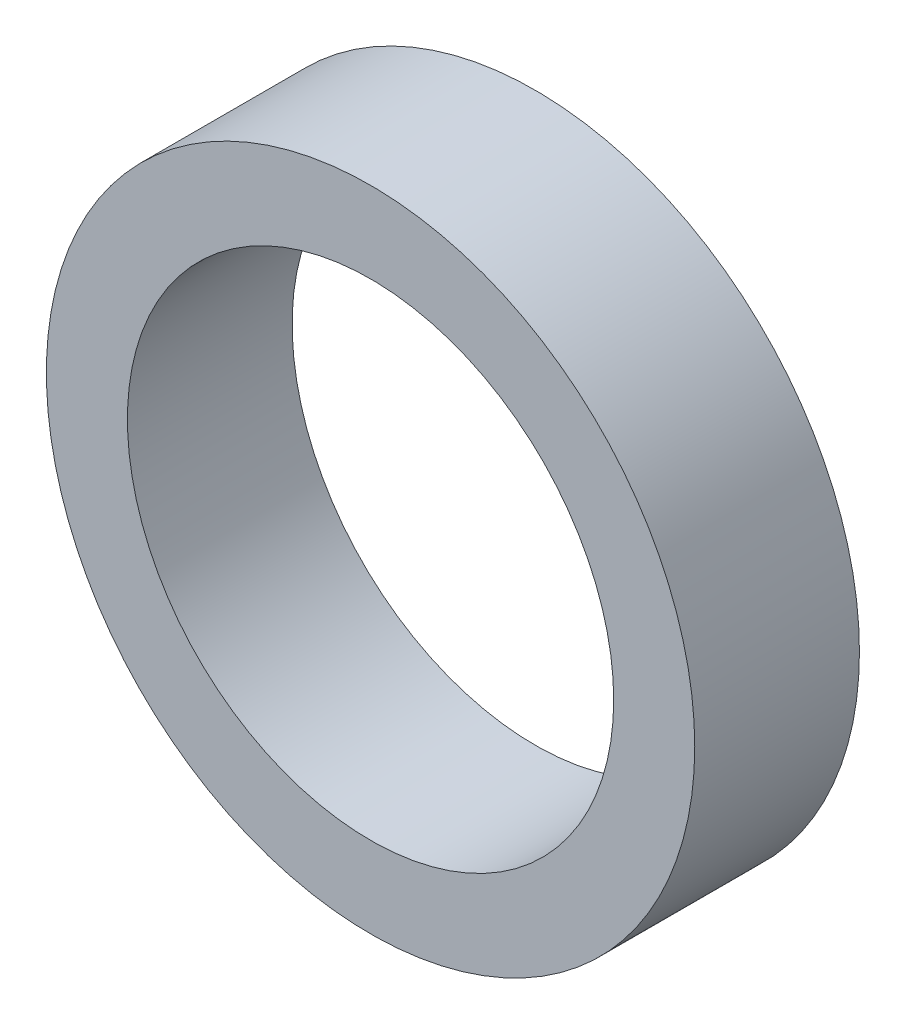
ISO-10303-21;
HEADER;
FILE_DESCRIPTION(('STEP AP214'),'2;1');
FILE_NAME('part.step','',(''),(''),'','','');
FILE_SCHEMA(('AUTOMOTIVE_DESIGN { 1 0 10303 214 1 1 1 1 }'));
ENDSEC;
DATA;
#1=APPLICATION_CONTEXT('core data for automotive mechanical design processes');
#2=APPLICATION_PROTOCOL_DEFINITION('international standard','automotive_design',2000,#1);
#3=PRODUCT_CONTEXT('',#1,'mechanical');
#4=PRODUCT('Part','Part','',(#3));
#5=PRODUCT_RELATED_PRODUCT_CATEGORY('part','',(#4));
#6=PRODUCT_DEFINITION_FORMATION('','',#4);
#7=PRODUCT_DEFINITION_CONTEXT('part definition',#1,'design');
#8=PRODUCT_DEFINITION('design','',#6,#7);
#9=PRODUCT_DEFINITION_SHAPE('','',#8);
#10=(LENGTH_UNIT() NAMED_UNIT(*) SI_UNIT(.MILLI.,.METRE.));
#11=(NAMED_UNIT(*) PLANE_ANGLE_UNIT() SI_UNIT($,.RADIAN.));
#12=(NAMED_UNIT(*) SI_UNIT($,.STERADIAN.) SOLID_ANGLE_UNIT());
#13=UNCERTAINTY_MEASURE_WITH_UNIT(LENGTH_MEASURE(1.E-05),#10,'distance_accuracy_value','');
#14=(GEOMETRIC_REPRESENTATION_CONTEXT(3) GLOBAL_UNCERTAINTY_ASSIGNED_CONTEXT((#13)) GLOBAL_UNIT_ASSIGNED_CONTEXT((#10,
#11,#12)) REPRESENTATION_CONTEXT('',''));
#15=CARTESIAN_POINT('',(0.,0.,0.));
#16=DIRECTION('',(0.,0.,1.));
#17=DIRECTION('',(1.,0.,0.));
#18=AXIS2_PLACEMENT_3D('',#15,#16,#17);
#19=CARTESIAN_POINT('',(0.,0.,1.016));
#20=DIRECTION('',(0.,0.,1.));
#21=DIRECTION('',(1.,0.,0.));
#22=AXIS2_PLACEMENT_3D('',#19,#20,#21);
#23=PLANE('',#22);
#24=CARTESIAN_POINT('',(0.,0.,1.016));
#25=DIRECTION('',(0.,0.,1.));
#26=DIRECTION('',(1.,0.,0.));
#27=AXIS2_PLACEMENT_3D('',#24,#25,#26);
#28=CIRCLE('',#27,2.);
#29=CARTESIAN_POINT('',(2.,0.,1.016));
#30=VERTEX_POINT('',#29);
#31=EDGE_CURVE('E10',#30,#30,#28,.T.);
#32=ORIENTED_EDGE('',*,*,#31,.T.);
#33=EDGE_LOOP('',(#32));
#34=FACE_BOUND('',#33,.T.);
#35=CARTESIAN_POINT('',(0.,0.,1.016));
#36=DIRECTION('',(0.,0.,1.));
#37=DIRECTION('',(1.,0.,0.));
#38=AXIS2_PLACEMENT_3D('',#35,#36,#37);
#39=CIRCLE('',#38,1.5);
#40=CARTESIAN_POINT('',(1.5,0.,1.016));
#41=VERTEX_POINT('',#40);
#42=EDGE_CURVE('E43',#41,#41,#39,.T.);
#43=ORIENTED_EDGE('',*,*,#42,.F.);
#44=EDGE_LOOP('',(#43));
#45=FACE_BOUND('',#44,.T.);
#46=ADVANCED_FACE('F32',(#34,#45),#23,.T.);
#47=CARTESIAN_POINT('',(0.,0.,0.));
#48=DIRECTION('',(0.,0.,1.));
#49=DIRECTION('',(1.,0.,0.));
#50=AXIS2_PLACEMENT_3D('',#47,#48,#49);
#51=PLANE('',#50);
#52=CARTESIAN_POINT('',(0.,0.,0.));
#53=DIRECTION('',(0.,0.,1.));
#54=DIRECTION('',(1.,0.,0.));
#55=AXIS2_PLACEMENT_3D('',#52,#53,#54);
#56=CIRCLE('',#55,2.);
#57=CARTESIAN_POINT('',(2.,0.,0.));
#58=VERTEX_POINT('',#57);
#59=EDGE_CURVE('E36',#58,#58,#56,.T.);
#60=ORIENTED_EDGE('',*,*,#59,.F.);
#61=EDGE_LOOP('',(#60));
#62=FACE_BOUND('',#61,.T.);
#63=CARTESIAN_POINT('',(0.,0.,0.));
#64=DIRECTION('',(0.,0.,1.));
#65=DIRECTION('',(1.,0.,0.));
#66=AXIS2_PLACEMENT_3D('',#63,#64,#65);
#67=CIRCLE('',#66,1.5);
#68=CARTESIAN_POINT('',(1.5,0.,0.));
#69=VERTEX_POINT('',#68);
#70=EDGE_CURVE('E45',#69,#69,#67,.T.);
#71=ORIENTED_EDGE('',*,*,#70,.T.);
#72=EDGE_LOOP('',(#71));
#73=FACE_BOUND('',#72,.T.);
#74=ADVANCED_FACE('F55',(#62,#73),#51,.F.);
#75=CARTESIAN_POINT('',(0.,0.,1.016));
#76=DIRECTION('',(0.,0.,-1.));
#77=DIRECTION('',(-1.,0.,0.));
#78=AXIS2_PLACEMENT_3D('',#75,#76,#77);
#79=CYLINDRICAL_SURFACE('',#78,2.);
#80=ORIENTED_EDGE('',*,*,#31,.F.);
#81=EDGE_LOOP('',(#80));
#82=FACE_BOUND('',#81,.T.);
#83=ORIENTED_EDGE('',*,*,#59,.T.);
#84=EDGE_LOOP('',(#83));
#85=FACE_BOUND('',#84,.T.);
#86=ADVANCED_FACE('F34',(#82,#85),#79,.T.);
#87=CARTESIAN_POINT('',(0.,0.,1.016));
#88=DIRECTION('',(0.,0.,-1.));
#89=DIRECTION('',(-1.,0.,0.));
#90=AXIS2_PLACEMENT_3D('',#87,#88,#89);
#91=CYLINDRICAL_SURFACE('',#90,1.5);
#92=ORIENTED_EDGE('',*,*,#42,.T.);
#93=EDGE_LOOP('',(#92));
#94=FACE_BOUND('',#93,.T.);
#95=ORIENTED_EDGE('',*,*,#70,.F.);
#96=EDGE_LOOP('',(#95));
#97=FACE_BOUND('',#96,.T.);
#98=ADVANCED_FACE('F51',(#94,#97),#91,.F.);
#99=CLOSED_SHELL('',(#46,#74,#86,#98));
#100=MANIFOLD_SOLID_BREP('B2',#99);
#101=ADVANCED_BREP_SHAPE_REPRESENTATION('',(#18,#100),#14);
#102=SHAPE_DEFINITION_REPRESENTATION(#9,#101);
ENDSEC;
END-ISO-10303-21;
